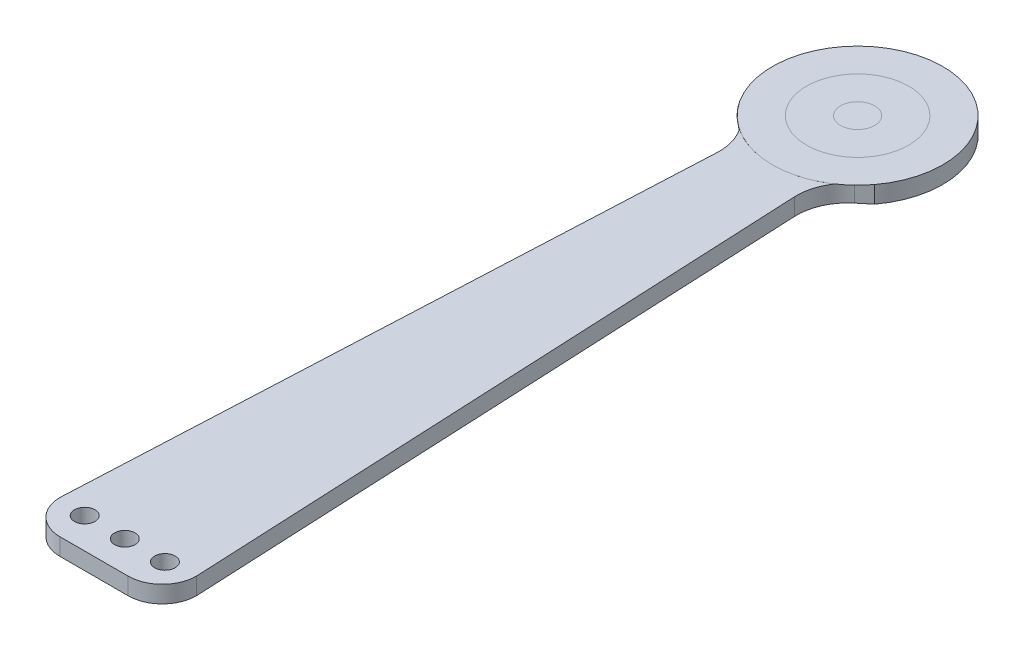
ISO-10303-21;
HEADER;
FILE_DESCRIPTION(('STEP AP214'),'2;1');
FILE_NAME('part.step','',(''),(''),'','','');
FILE_SCHEMA(('AUTOMOTIVE_DESIGN { 1 0 10303 214 1 1 1 1 }'));
ENDSEC;
DATA;
#1=APPLICATION_CONTEXT('core data for automotive mechanical design processes');
#2=APPLICATION_PROTOCOL_DEFINITION('international standard','automotive_design',2000,#1);
#3=PRODUCT_CONTEXT('',#1,'mechanical');
#4=PRODUCT('Part','Part','',(#3));
#5=PRODUCT_RELATED_PRODUCT_CATEGORY('part','',(#4));
#6=PRODUCT_DEFINITION_FORMATION('','',#4);
#7=PRODUCT_DEFINITION_CONTEXT('part definition',#1,'design');
#8=PRODUCT_DEFINITION('design','',#6,#7);
#9=PRODUCT_DEFINITION_SHAPE('','',#8);
#10=(LENGTH_UNIT() NAMED_UNIT(*) SI_UNIT(.MILLI.,.METRE.));
#11=(NAMED_UNIT(*) PLANE_ANGLE_UNIT() SI_UNIT($,.RADIAN.));
#12=(NAMED_UNIT(*) SI_UNIT($,.STERADIAN.) SOLID_ANGLE_UNIT());
#13=UNCERTAINTY_MEASURE_WITH_UNIT(LENGTH_MEASURE(1.E-05),#10,'distance_accuracy_value','');
#14=(GEOMETRIC_REPRESENTATION_CONTEXT(3) GLOBAL_UNCERTAINTY_ASSIGNED_CONTEXT((#13)) GLOBAL_UNIT_ASSIGNED_CONTEXT((#10,
#11,#12)) REPRESENTATION_CONTEXT('',''));
#15=CARTESIAN_POINT('',(0.,0.,0.));
#16=DIRECTION('',(0.,0.,1.));
#17=DIRECTION('',(1.,0.,0.));
#18=AXIS2_PLACEMENT_3D('',#15,#16,#17);
#19=CARTESIAN_POINT('',(0.,5.,0.));
#20=DIRECTION('',(0.,-1.,0.));
#21=DIRECTION('',(0.,0.,-1.));
#22=AXIS2_PLACEMENT_3D('',#19,#20,#21);
#23=CYLINDRICAL_SURFACE('',#22,25.);
#24=CARTESIAN_POINT('',(0.,4.9999,0.));
#25=DIRECTION('',(0.,1.,0.));
#26=DIRECTION('',(0.,0.,1.));
#27=AXIS2_PLACEMENT_3D('',#24,#25,#26);
#28=CIRCLE('',#27,25.);
#29=CARTESIAN_POINT('',(-20.,4.9999,15.));
#30=VERTEX_POINT('',#29);
#31=CARTESIAN_POINT('',(-13.8750923483834,4.9999,20.7961970639786));
#32=VERTEX_POINT('',#31);
#33=EDGE_CURVE('E240',#30,#32,#28,.T.);
#34=ORIENTED_EDGE('',*,*,#33,.T.);
#35=CARTESIAN_POINT('',(13.9801485717998,4.9999,20.7257194304662));
#36=VERTEX_POINT('',#35);
#37=EDGE_CURVE('E57',#32,#36,#28,.T.);
#38=ORIENTED_EDGE('',*,*,#37,.T.);
#39=CARTESIAN_POINT('',(0.,4.9999,0.));
#40=DIRECTION('',(0.,1.,0.));
#41=DIRECTION('',(0.,0.,1.));
#42=AXIS2_PLACEMENT_3D('',#39,#40,#41);
#43=CIRCLE('',#42,25.);
#44=CARTESIAN_POINT('',(20.,4.9999,15.));
#45=VERTEX_POINT('',#44);
#46=EDGE_CURVE('E122',#36,#45,#43,.T.);
#47=ORIENTED_EDGE('',*,*,#46,.T.);
#48=DIRECTION('',(0.,-1.,0.));
#49=VECTOR('',#48,1.);
#50=CARTESIAN_POINT('',(20.,5.,15.));
#51=LINE('',#50,#49);
#52=CARTESIAN_POINT('',(20.,0.,15.));
#53=VERTEX_POINT('',#52);
#54=EDGE_CURVE('E155',#45,#53,#51,.T.);
#55=ORIENTED_EDGE('',*,*,#54,.T.);
#56=CARTESIAN_POINT('',(0.,0.,0.));
#57=DIRECTION('',(0.,1.,0.));
#58=DIRECTION('',(0.,0.,1.));
#59=AXIS2_PLACEMENT_3D('',#56,#57,#58);
#60=CIRCLE('',#59,25.);
#61=CARTESIAN_POINT('',(-20.,0.,15.));
#62=VERTEX_POINT('',#61);
#63=EDGE_CURVE('E229',#53,#62,#60,.T.);
#64=ORIENTED_EDGE('',*,*,#63,.T.);
#65=DIRECTION('',(0.,-1.,0.));
#66=VECTOR('',#65,1.);
#67=CARTESIAN_POINT('',(-20.,5.,15.));
#68=LINE('',#67,#66);
#69=EDGE_CURVE('E196',#30,#62,#68,.T.);
#70=ORIENTED_EDGE('',*,*,#69,.F.);
#71=EDGE_LOOP('',(#34,#38,#47,#55,#64,#70));
#72=FACE_BOUND('',#71,.T.);
#73=CARTESIAN_POINT('',(0.,5.,0.));
#74=DIRECTION('',(0.,1.,0.));
#75=DIRECTION('',(0.,0.,1.));
#76=AXIS2_PLACEMENT_3D('',#73,#74,#75);
#77=CIRCLE('',#76,25.);
#78=CARTESIAN_POINT('',(0.,5.,25.));
#79=VERTEX_POINT('',#78);
#80=EDGE_CURVE('E233',#79,#79,#77,.T.);
#81=ORIENTED_EDGE('',*,*,#80,.F.);
#82=EDGE_LOOP('',(#81));
#83=FACE_BOUND('',#82,.T.);
#84=ADVANCED_FACE('F41',(#72,#83),#23,.T.);
#85=CARTESIAN_POINT('',(0.,5.,0.));
#86=DIRECTION('',(0.,1.,0.));
#87=DIRECTION('',(0.,0.,1.));
#88=AXIS2_PLACEMENT_3D('',#85,#86,#87);
#89=PLANE('',#88);
#90=CARTESIAN_POINT('',(0.,5.,0.));
#91=DIRECTION('',(0.,1.,0.));
#92=DIRECTION('',(0.,0.,1.));
#93=AXIS2_PLACEMENT_3D('',#90,#91,#92);
#94=CIRCLE('',#93,15.);
#95=CARTESIAN_POINT('',(0.,5.,15.));
#96=VERTEX_POINT('',#95);
#97=EDGE_CURVE('E225',#96,#96,#94,.T.);
#98=ORIENTED_EDGE('',*,*,#97,.F.);
#99=EDGE_LOOP('',(#98));
#100=FACE_BOUND('',#99,.T.);
#101=ORIENTED_EDGE('',*,*,#80,.T.);
#102=EDGE_LOOP('',(#101));
#103=FACE_BOUND('',#102,.T.);
#104=ADVANCED_FACE('F328',(#100,#103),#89,.T.);
#105=CARTESIAN_POINT('',(0.,0.,0.));
#106=DIRECTION('',(0.,1.,0.));
#107=DIRECTION('',(0.,0.,1.));
#108=AXIS2_PLACEMENT_3D('',#105,#106,#107);
#109=PLANE('',#108);
#110=DIRECTION('',(-0.770252004426465,0.,0.637739640979776));
#111=VECTOR('',#110,1.);
#112=CARTESIAN_POINT('',(11.0050810900871,0.,22.447453980365));
#113=LINE('',#112,#111);
#114=CARTESIAN_POINT('',(16.7737738304887,0.,17.6711937226255));
#115=VERTEX_POINT('',#114);
#116=EDGE_CURVE('E109',#53,#115,#113,.T.);
#117=ORIENTED_EDGE('',*,*,#116,.T.);
#118=CARTESIAN_POINT('',(26.3398684451853,0.,29.2249737890225));
#119=DIRECTION('',(0.,1.,0.));
#120=DIRECTION('',(0.,0.,1.));
#121=AXIS2_PLACEMENT_3D('',#118,#119,#120);
#122=CIRCLE('',#121,15.);
#123=CARTESIAN_POINT('',(11.356379028025,0.,29.9285680512522));
#124=VERTEX_POINT('',#123);
#125=EDGE_CURVE('E11',#115,#124,#122,.T.);
#126=ORIENTED_EDGE('',*,*,#125,.T.);
#127=DIRECTION('',(0.0469062841486432,0.,0.99889929447736));
#128=VECTOR('',#127,1.);
#129=CARTESIAN_POINT('',(20.,0.,214.));
#130=LINE('',#129,#128);
#131=CARTESIAN_POINT('',(20.,0.,214.));
#132=VERTEX_POINT('',#131);
#133=EDGE_CURVE('E106',#124,#132,#130,.T.);
#134=ORIENTED_EDGE('',*,*,#133,.T.);
#135=CARTESIAN_POINT('',(10.,0.,214.));
#136=DIRECTION('',(0.,1.,0.));
#137=DIRECTION('',(0.,0.,1.));
#138=AXIS2_PLACEMENT_3D('',#135,#136,#137);
#139=CIRCLE('',#138,10.);
#140=CARTESIAN_POINT('',(10.,0.,224.));
#141=VERTEX_POINT('',#140);
#142=EDGE_CURVE('E251',#132,#141,#139,.F.);
#143=ORIENTED_EDGE('',*,*,#142,.T.);
#144=DIRECTION('',(1.,0.,0.));
#145=VECTOR('',#144,1.);
#146=CARTESIAN_POINT('',(0.,0.,224.));
#147=LINE('',#146,#145);
#148=CARTESIAN_POINT('',(-9.99999999999997,0.,224.));
#149=VERTEX_POINT('',#148);
#150=EDGE_CURVE('E184',#149,#141,#147,.T.);
#151=ORIENTED_EDGE('',*,*,#150,.F.);
#152=CARTESIAN_POINT('',(-9.99999999999997,0.,214.));
#153=DIRECTION('',(0.,1.,0.));
#154=DIRECTION('',(0.,0.,1.));
#155=AXIS2_PLACEMENT_3D('',#152,#153,#154);
#156=CIRCLE('',#155,10.);
#157=CARTESIAN_POINT('',(-20.,0.,214.));
#158=VERTEX_POINT('',#157);
#159=EDGE_CURVE('E254',#149,#158,#156,.F.);
#160=ORIENTED_EDGE('',*,*,#159,.T.);
#161=DIRECTION('',(0.0475146342625764,0.,-0.998870541927678));
#162=VECTOR('',#161,1.);
#163=CARTESIAN_POINT('',(-20.,0.,214.));
#164=LINE('',#163,#162);
#165=CARTESIAN_POINT('',(-11.2480653517147,0.,30.0135326573741));
#166=VERTEX_POINT('',#165);
#167=EDGE_CURVE('E162',#158,#166,#164,.T.);
#168=ORIENTED_EDGE('',*,*,#167,.T.);
#169=CARTESIAN_POINT('',(-26.2311234806299,0.,29.3008131434355));
#170=DIRECTION('',(0.,1.,0.));
#171=DIRECTION('',(0.,0.,1.));
#172=AXIS2_PLACEMENT_3D('',#169,#170,#171);
#173=CIRCLE('',#172,15.);
#174=CARTESIAN_POINT('',(-16.6944318337419,0.,17.7227514562541));
#175=VERTEX_POINT('',#174);
#176=EDGE_CURVE('E88',#166,#175,#173,.T.);
#177=ORIENTED_EDGE('',*,*,#176,.T.);
#178=DIRECTION('',(-0.771870779145422,0.,-0.635779443125868));
#179=VECTOR('',#178,1.);
#180=CARTESIAN_POINT('',(-10.8908072359637,0.,22.5031179561651));
#181=LINE('',#180,#179);
#182=EDGE_CURVE('E157',#175,#62,#181,.T.);
#183=ORIENTED_EDGE('',*,*,#182,.T.);
#184=ORIENTED_EDGE('',*,*,#63,.F.);
#185=EDGE_LOOP('',(#117,#126,#134,#143,#151,#160,#168,#177,#183,#184));
#186=FACE_BOUND('',#185,.T.);
#187=CARTESIAN_POINT('',(-11.77,0.,215.));
#188=DIRECTION('',(0.,1.,0.));
#189=DIRECTION('',(0.,0.,1.));
#190=AXIS2_PLACEMENT_3D('',#187,#188,#189);
#191=CIRCLE('',#190,3.);
#192=CARTESIAN_POINT('',(-11.77,0.,218.));
#193=VERTEX_POINT('',#192);
#194=EDGE_CURVE('E178',#193,#193,#191,.T.);
#195=ORIENTED_EDGE('',*,*,#194,.T.);
#196=EDGE_LOOP('',(#195));
#197=FACE_BOUND('',#196,.T.);
#198=CARTESIAN_POINT('',(11.77,0.,215.));
#199=DIRECTION('',(0.,1.,0.));
#200=DIRECTION('',(0.,0.,1.));
#201=AXIS2_PLACEMENT_3D('',#198,#199,#200);
#202=CIRCLE('',#201,3.);
#203=CARTESIAN_POINT('',(11.77,0.,218.));
#204=VERTEX_POINT('',#203);
#205=EDGE_CURVE('E200',#204,#204,#202,.T.);
#206=ORIENTED_EDGE('',*,*,#205,.T.);
#207=EDGE_LOOP('',(#206));
#208=FACE_BOUND('',#207,.T.);
#209=CARTESIAN_POINT('',(0.,0.,215.));
#210=DIRECTION('',(0.,1.,0.));
#211=DIRECTION('',(0.,0.,1.));
#212=AXIS2_PLACEMENT_3D('',#209,#210,#211);
#213=CIRCLE('',#212,3.);
#214=CARTESIAN_POINT('',(0.,0.,218.));
#215=VERTEX_POINT('',#214);
#216=EDGE_CURVE('E204',#215,#215,#213,.T.);
#217=ORIENTED_EDGE('',*,*,#216,.T.);
#218=EDGE_LOOP('',(#217));
#219=FACE_BOUND('',#218,.T.);
#220=ADVANCED_FACE('F102',(#186,#197,#208,#219),#109,.F.);
#221=CARTESIAN_POINT('',(0.,5.0001,0.));
#222=DIRECTION('',(0.,-1.,0.));
#223=DIRECTION('',(0.,0.,-1.));
#224=AXIS2_PLACEMENT_3D('',#221,#222,#223);
#225=CYLINDRICAL_SURFACE('',#224,15.);
#226=CARTESIAN_POINT('',(0.,5.0001,0.));
#227=DIRECTION('',(0.,1.,0.));
#228=DIRECTION('',(0.,0.,1.));
#229=AXIS2_PLACEMENT_3D('',#226,#227,#228);
#230=CIRCLE('',#229,15.);
#231=CARTESIAN_POINT('',(0.,5.0001,15.));
#232=VERTEX_POINT('',#231);
#233=EDGE_CURVE('E220',#232,#232,#230,.T.);
#234=ORIENTED_EDGE('',*,*,#233,.F.);
#235=EDGE_LOOP('',(#234));
#236=FACE_BOUND('',#235,.T.);
#237=ORIENTED_EDGE('',*,*,#97,.T.);
#238=EDGE_LOOP('',(#237));
#239=FACE_BOUND('',#238,.T.);
#240=ADVANCED_FACE('F413',(#236,#239),#225,.T.);
#241=CARTESIAN_POINT('',(0.,5.0001,0.));
#242=DIRECTION('',(0.,1.,0.));
#243=DIRECTION('',(0.,0.,1.));
#244=AXIS2_PLACEMENT_3D('',#241,#242,#243);
#245=PLANE('',#244);
#246=CARTESIAN_POINT('',(0.,5.0001,0.));
#247=DIRECTION('',(0.,1.,0.));
#248=DIRECTION('',(0.,0.,1.));
#249=AXIS2_PLACEMENT_3D('',#246,#247,#248);
#250=CIRCLE('',#249,5.);
#251=CARTESIAN_POINT('',(0.,5.0001,5.));
#252=VERTEX_POINT('',#251);
#253=EDGE_CURVE('E221',#252,#252,#250,.T.);
#254=ORIENTED_EDGE('',*,*,#253,.F.);
#255=EDGE_LOOP('',(#254));
#256=FACE_BOUND('',#255,.T.);
#257=ORIENTED_EDGE('',*,*,#233,.T.);
#258=EDGE_LOOP('',(#257));
#259=FACE_BOUND('',#258,.T.);
#260=ADVANCED_FACE('F489',(#256,#259),#245,.T.);
#261=CARTESIAN_POINT('',(0.,5.0002,0.));
#262=DIRECTION('',(0.,-1.,0.));
#263=DIRECTION('',(0.,0.,-1.));
#264=AXIS2_PLACEMENT_3D('',#261,#262,#263);
#265=CYLINDRICAL_SURFACE('',#264,5.);
#266=CARTESIAN_POINT('',(0.,5.0002,0.));
#267=DIRECTION('',(0.,1.,0.));
#268=DIRECTION('',(0.,0.,1.));
#269=AXIS2_PLACEMENT_3D('',#266,#267,#268);
#270=CIRCLE('',#269,5.);
#271=CARTESIAN_POINT('',(0.,5.0002,5.));
#272=VERTEX_POINT('',#271);
#273=EDGE_CURVE('E216',#272,#272,#270,.T.);
#274=ORIENTED_EDGE('',*,*,#273,.F.);
#275=EDGE_LOOP('',(#274));
#276=FACE_BOUND('',#275,.T.);
#277=ORIENTED_EDGE('',*,*,#253,.T.);
#278=EDGE_LOOP('',(#277));
#279=FACE_BOUND('',#278,.T.);
#280=ADVANCED_FACE('F478',(#276,#279),#265,.T.);
#281=CARTESIAN_POINT('',(0.,5.0002,0.));
#282=DIRECTION('',(0.,1.,0.));
#283=DIRECTION('',(0.,0.,1.));
#284=AXIS2_PLACEMENT_3D('',#281,#282,#283);
#285=PLANE('',#284);
#286=ORIENTED_EDGE('',*,*,#273,.T.);
#287=EDGE_LOOP('',(#286));
#288=FACE_BOUND('',#287,.T.);
#289=ADVANCED_FACE('F468',(#288),#285,.T.);
#290=CARTESIAN_POINT('',(0.,4.9999,215.));
#291=DIRECTION('',(0.,-1.,0.));
#292=DIRECTION('',(0.,0.,-1.));
#293=AXIS2_PLACEMENT_3D('',#290,#291,#292);
#294=CYLINDRICAL_SURFACE('',#293,3.);
#295=CARTESIAN_POINT('',(0.,4.9999,215.));
#296=DIRECTION('',(0.,1.,0.));
#297=DIRECTION('',(0.,0.,1.));
#298=AXIS2_PLACEMENT_3D('',#295,#296,#297);
#299=CIRCLE('',#298,3.);
#300=CARTESIAN_POINT('',(0.,4.9999,218.));
#301=VERTEX_POINT('',#300);
#302=EDGE_CURVE('E188',#301,#301,#299,.T.);
#303=ORIENTED_EDGE('',*,*,#302,.T.);
#304=EDGE_LOOP('',(#303));
#305=FACE_BOUND('',#304,.T.);
#306=ORIENTED_EDGE('',*,*,#216,.F.);
#307=EDGE_LOOP('',(#306));
#308=FACE_BOUND('',#307,.T.);
#309=ADVANCED_FACE('F459',(#305,#308),#294,.F.);
#310=CARTESIAN_POINT('',(11.77,4.9999,215.));
#311=DIRECTION('',(0.,-1.,0.));
#312=DIRECTION('',(0.,0.,-1.));
#313=AXIS2_PLACEMENT_3D('',#310,#311,#312);
#314=CYLINDRICAL_SURFACE('',#313,3.);
#315=CARTESIAN_POINT('',(11.77,4.9999,215.));
#316=DIRECTION('',(0.,1.,0.));
#317=DIRECTION('',(0.,0.,1.));
#318=AXIS2_PLACEMENT_3D('',#315,#316,#317);
#319=CIRCLE('',#318,3.);
#320=CARTESIAN_POINT('',(11.77,4.9999,218.));
#321=VERTEX_POINT('',#320);
#322=EDGE_CURVE('E183',#321,#321,#319,.T.);
#323=ORIENTED_EDGE('',*,*,#322,.T.);
#324=EDGE_LOOP('',(#323));
#325=FACE_BOUND('',#324,.T.);
#326=ORIENTED_EDGE('',*,*,#205,.F.);
#327=EDGE_LOOP('',(#326));
#328=FACE_BOUND('',#327,.T.);
#329=ADVANCED_FACE('F449',(#325,#328),#314,.F.);
#330=CARTESIAN_POINT('',(-11.77,4.9999,215.));
#331=DIRECTION('',(0.,-1.,0.));
#332=DIRECTION('',(0.,0.,-1.));
#333=AXIS2_PLACEMENT_3D('',#330,#331,#332);
#334=CYLINDRICAL_SURFACE('',#333,3.);
#335=CARTESIAN_POINT('',(-11.77,4.9999,215.));
#336=DIRECTION('',(0.,1.,0.));
#337=DIRECTION('',(0.,0.,1.));
#338=AXIS2_PLACEMENT_3D('',#335,#336,#337);
#339=CIRCLE('',#338,3.);
#340=CARTESIAN_POINT('',(-11.77,4.9999,218.));
#341=VERTEX_POINT('',#340);
#342=EDGE_CURVE('E179',#341,#341,#339,.T.);
#343=ORIENTED_EDGE('',*,*,#342,.T.);
#344=EDGE_LOOP('',(#343));
#345=FACE_BOUND('',#344,.T.);
#346=ORIENTED_EDGE('',*,*,#194,.F.);
#347=EDGE_LOOP('',(#346));
#348=FACE_BOUND('',#347,.T.);
#349=ADVANCED_FACE('F439',(#345,#348),#334,.F.);
#350=CARTESIAN_POINT('',(0.,4.9999,224.));
#351=DIRECTION('',(0.,0.,-1.));
#352=DIRECTION('',(-1.,0.,0.));
#353=AXIS2_PLACEMENT_3D('',#350,#351,#352);
#354=PLANE('',#353);
#355=DIRECTION('',(1.,0.,0.));
#356=VECTOR('',#355,1.);
#357=CARTESIAN_POINT('',(0.,4.9999,224.));
#358=LINE('',#357,#356);
#359=CARTESIAN_POINT('',(-9.99999999999997,4.9999,224.));
#360=VERTEX_POINT('',#359);
#361=CARTESIAN_POINT('',(10.,4.9999,224.));
#362=VERTEX_POINT('',#361);
#363=EDGE_CURVE('E192',#360,#362,#358,.T.);
#364=ORIENTED_EDGE('',*,*,#363,.F.);
#365=DIRECTION('',(0.,-1.,0.));
#366=VECTOR('',#365,1.);
#367=CARTESIAN_POINT('',(-9.99999999999997,4.9999,224.));
#368=LINE('',#367,#366);
#369=EDGE_CURVE('E247',#360,#149,#368,.T.);
#370=ORIENTED_EDGE('',*,*,#369,.T.);
#371=ORIENTED_EDGE('',*,*,#150,.T.);
#372=DIRECTION('',(0.,-1.,0.));
#373=VECTOR('',#372,1.);
#374=CARTESIAN_POINT('',(10.,4.9999,224.));
#375=LINE('',#374,#373);
#376=EDGE_CURVE('E243',#141,#362,#375,.F.);
#377=ORIENTED_EDGE('',*,*,#376,.T.);
#378=EDGE_LOOP('',(#364,#370,#371,#377));
#379=FACE_BOUND('',#378,.T.);
#380=ADVANCED_FACE('F402',(#379),#354,.F.);
#381=CARTESIAN_POINT('',(0.,4.9999,0.));
#382=DIRECTION('',(0.,1.,0.));
#383=DIRECTION('',(0.,0.,1.));
#384=AXIS2_PLACEMENT_3D('',#381,#382,#383);
#385=PLANE('',#384);
#386=DIRECTION('',(0.0469062841486432,0.,0.99889929447736));
#387=VECTOR('',#386,1.);
#388=CARTESIAN_POINT('',(20.,4.9999,214.));
#389=LINE('',#388,#387);
#390=CARTESIAN_POINT('',(11.356379028025,4.9999,29.9285680512522));
#391=VERTEX_POINT('',#390);
#392=CARTESIAN_POINT('',(20.,4.9999,214.));
#393=VERTEX_POINT('',#392);
#394=EDGE_CURVE('E146',#391,#393,#389,.T.);
#395=ORIENTED_EDGE('',*,*,#394,.F.);
#396=CARTESIAN_POINT('',(26.3398684451853,4.9999,29.2249737890225));
#397=DIRECTION('',(0.,1.,0.));
#398=DIRECTION('',(0.,0.,1.));
#399=AXIS2_PLACEMENT_3D('',#396,#397,#398);
#400=CIRCLE('',#399,15.);
#401=EDGE_CURVE('E50',#391,#36,#400,.F.);
#402=ORIENTED_EDGE('',*,*,#401,.T.);
#403=ORIENTED_EDGE('',*,*,#37,.F.);
#404=CARTESIAN_POINT('',(-26.2311234806299,4.9999,29.3008131434355));
#405=DIRECTION('',(0.,1.,0.));
#406=DIRECTION('',(0.,0.,1.));
#407=AXIS2_PLACEMENT_3D('',#404,#405,#406);
#408=CIRCLE('',#407,15.);
#409=CARTESIAN_POINT('',(-11.2480653517147,4.9999,30.0135326573741));
#410=VERTEX_POINT('',#409);
#411=EDGE_CURVE('E138',#32,#410,#408,.F.);
#412=ORIENTED_EDGE('',*,*,#411,.T.);
#413=DIRECTION('',(0.0475146342625764,0.,-0.998870541927678));
#414=VECTOR('',#413,1.);
#415=CARTESIAN_POINT('',(-20.,4.9999,214.));
#416=LINE('',#415,#414);
#417=CARTESIAN_POINT('',(-20.,4.9999,214.));
#418=VERTEX_POINT('',#417);
#419=EDGE_CURVE('E169',#418,#410,#416,.T.);
#420=ORIENTED_EDGE('',*,*,#419,.F.);
#421=CARTESIAN_POINT('',(-9.99999999999997,4.9999,214.));
#422=DIRECTION('',(0.,1.,0.));
#423=DIRECTION('',(0.,0.,1.));
#424=AXIS2_PLACEMENT_3D('',#421,#422,#423);
#425=CIRCLE('',#424,10.);
#426=EDGE_CURVE('E265',#418,#360,#425,.T.);
#427=ORIENTED_EDGE('',*,*,#426,.T.);
#428=ORIENTED_EDGE('',*,*,#363,.T.);
#429=CARTESIAN_POINT('',(10.,4.9999,214.));
#430=DIRECTION('',(0.,1.,0.));
#431=DIRECTION('',(0.,0.,1.));
#432=AXIS2_PLACEMENT_3D('',#429,#430,#431);
#433=CIRCLE('',#432,10.);
#434=EDGE_CURVE('E262',#362,#393,#433,.T.);
#435=ORIENTED_EDGE('',*,*,#434,.T.);
#436=EDGE_LOOP('',(#395,#402,#403,#412,#420,#427,#428,#435));
#437=FACE_BOUND('',#436,.T.);
#438=ORIENTED_EDGE('',*,*,#342,.F.);
#439=EDGE_LOOP('',(#438));
#440=FACE_BOUND('',#439,.T.);
#441=ORIENTED_EDGE('',*,*,#322,.F.);
#442=EDGE_LOOP('',(#441));
#443=FACE_BOUND('',#442,.T.);
#444=ORIENTED_EDGE('',*,*,#302,.F.);
#445=EDGE_LOOP('',(#444));
#446=FACE_BOUND('',#445,.T.);
#447=ADVANCED_FACE('F143',(#437,#440,#443,#446),#385,.T.);
#448=CARTESIAN_POINT('',(-9.99999999999997,4.9999,214.));
#449=DIRECTION('',(0.,-1.,0.));
#450=DIRECTION('',(0.,0.,-1.));
#451=AXIS2_PLACEMENT_3D('',#448,#449,#450);
#452=CYLINDRICAL_SURFACE('',#451,10.);
#453=ORIENTED_EDGE('',*,*,#426,.F.);
#454=DIRECTION('',(0.,-1.,0.));
#455=VECTOR('',#454,1.);
#456=CARTESIAN_POINT('',(-20.,4.9999,214.));
#457=LINE('',#456,#455);
#458=EDGE_CURVE('E258',#158,#418,#457,.F.);
#459=ORIENTED_EDGE('',*,*,#458,.F.);
#460=ORIENTED_EDGE('',*,*,#159,.F.);
#461=ORIENTED_EDGE('',*,*,#369,.F.);
#462=EDGE_LOOP('',(#453,#459,#460,#461));
#463=FACE_BOUND('',#462,.T.);
#464=ADVANCED_FACE('F298',(#463),#452,.T.);
#465=CARTESIAN_POINT('',(10.,4.9999,214.));
#466=DIRECTION('',(0.,1.,0.));
#467=DIRECTION('',(0.,0.,1.));
#468=AXIS2_PLACEMENT_3D('',#465,#466,#467);
#469=CYLINDRICAL_SURFACE('',#468,10.);
#470=ORIENTED_EDGE('',*,*,#434,.F.);
#471=ORIENTED_EDGE('',*,*,#376,.F.);
#472=ORIENTED_EDGE('',*,*,#142,.F.);
#473=DIRECTION('',(0.,-1.,0.));
#474=VECTOR('',#473,1.);
#475=CARTESIAN_POINT('',(20.,0.,214.));
#476=LINE('',#475,#474);
#477=EDGE_CURVE('E119',#393,#132,#476,.T.);
#478=ORIENTED_EDGE('',*,*,#477,.F.);
#479=EDGE_LOOP('',(#470,#471,#472,#478));
#480=FACE_BOUND('',#479,.T.);
#481=ADVANCED_FACE('F339',(#480),#469,.T.);
#482=CARTESIAN_POINT('',(0.,4.9999,0.));
#483=DIRECTION('',(0.,1.,0.));
#484=DIRECTION('',(0.,0.,1.));
#485=AXIS2_PLACEMENT_3D('',#482,#483,#484);
#486=PLANE('',#485);
#487=ORIENTED_EDGE('',*,*,#46,.F.);
#488=CARTESIAN_POINT('',(26.3398684451853,4.9999,29.2249737890225));
#489=DIRECTION('',(0.,1.,0.));
#490=DIRECTION('',(0.,0.,1.));
#491=AXIS2_PLACEMENT_3D('',#488,#489,#490);
#492=CIRCLE('',#491,15.);
#493=CARTESIAN_POINT('',(16.7737738304887,4.9999,17.6711937226255));
#494=VERTEX_POINT('',#493);
#495=EDGE_CURVE('E126',#36,#494,#492,.F.);
#496=ORIENTED_EDGE('',*,*,#495,.T.);
#497=DIRECTION('',(-0.770252004426465,0.,0.637739640979776));
#498=VECTOR('',#497,1.);
#499=CARTESIAN_POINT('',(11.0050810900871,4.9999,22.447453980365));
#500=LINE('',#499,#498);
#501=EDGE_CURVE('E151',#45,#494,#500,.T.);
#502=ORIENTED_EDGE('',*,*,#501,.F.);
#503=EDGE_LOOP('',(#487,#496,#502));
#504=FACE_BOUND('',#503,.T.);
#505=ADVANCED_FACE('F149',(#504),#486,.F.);
#506=CARTESIAN_POINT('',(20.,0.,214.));
#507=DIRECTION('',(-0.99889929447736,0.,0.0469062841486432));
#508=DIRECTION('',(0.0469062841486432,0.,0.99889929447736));
#509=AXIS2_PLACEMENT_3D('',#506,#507,#508);
#510=PLANE('',#509);
#511=ORIENTED_EDGE('',*,*,#133,.F.);
#512=DIRECTION('',(0.,1.,0.));
#513=VECTOR('',#512,1.);
#514=CARTESIAN_POINT('',(11.3563790280249,4.9999,29.9285680512522));
#515=LINE('',#514,#513);
#516=EDGE_CURVE('E116',#124,#391,#515,.T.);
#517=ORIENTED_EDGE('',*,*,#516,.T.);
#518=ORIENTED_EDGE('',*,*,#394,.T.);
#519=ORIENTED_EDGE('',*,*,#477,.T.);
#520=EDGE_LOOP('',(#511,#517,#518,#519));
#521=FACE_BOUND('',#520,.T.);
#522=ADVANCED_FACE('F114',(#521),#510,.F.);
#523=CARTESIAN_POINT('',(11.0050810900871,0.,22.447453980365));
#524=DIRECTION('',(-0.637739640979776,0.,-0.770252004426465));
#525=DIRECTION('',(-0.770252004426465,0.,0.637739640979776));
#526=AXIS2_PLACEMENT_3D('',#523,#524,#525);
#527=PLANE('',#526);
#528=ORIENTED_EDGE('',*,*,#501,.T.);
#529=DIRECTION('',(0.,1.,0.));
#530=VECTOR('',#529,1.);
#531=CARTESIAN_POINT('',(16.7737738304887,0.,17.6711937226255));
#532=LINE('',#531,#530);
#533=EDGE_CURVE('E66',#494,#115,#532,.F.);
#534=ORIENTED_EDGE('',*,*,#533,.T.);
#535=ORIENTED_EDGE('',*,*,#116,.F.);
#536=ORIENTED_EDGE('',*,*,#54,.F.);
#537=EDGE_LOOP('',(#528,#534,#535,#536));
#538=FACE_BOUND('',#537,.T.);
#539=ADVANCED_FACE('F153',(#538),#527,.F.);
#540=CARTESIAN_POINT('',(0.,4.9999,0.));
#541=DIRECTION('',(0.,-1.,0.));
#542=DIRECTION('',(0.,0.,-1.));
#543=AXIS2_PLACEMENT_3D('',#540,#541,#542);
#544=PLANE('',#543);
#545=DIRECTION('',(-0.771870779145422,0.,-0.635779443125868));
#546=VECTOR('',#545,1.);
#547=CARTESIAN_POINT('',(-10.8908072359637,4.9999,22.5031179561651));
#548=LINE('',#547,#546);
#549=CARTESIAN_POINT('',(-16.6944318337419,4.9999,17.7227514562541));
#550=VERTEX_POINT('',#549);
#551=EDGE_CURVE('E167',#550,#30,#548,.T.);
#552=ORIENTED_EDGE('',*,*,#551,.F.);
#553=CARTESIAN_POINT('',(-26.2311234806299,4.9999,29.3008131434355));
#554=DIRECTION('',(0.,-1.,0.));
#555=DIRECTION('',(0.,0.,-1.));
#556=AXIS2_PLACEMENT_3D('',#553,#554,#555);
#557=CIRCLE('',#556,15.);
#558=EDGE_CURVE('E132',#550,#32,#557,.T.);
#559=ORIENTED_EDGE('',*,*,#558,.T.);
#560=ORIENTED_EDGE('',*,*,#33,.F.);
#561=EDGE_LOOP('',(#552,#559,#560));
#562=FACE_BOUND('',#561,.T.);
#563=ADVANCED_FACE('F278',(#562),#544,.T.);
#564=CARTESIAN_POINT('',(-10.8908072359637,0.,22.5031179561651));
#565=DIRECTION('',(0.635779443125868,0.,-0.771870779145422));
#566=DIRECTION('',(-0.771870779145422,0.,-0.635779443125868));
#567=AXIS2_PLACEMENT_3D('',#564,#565,#566);
#568=PLANE('',#567);
#569=ORIENTED_EDGE('',*,*,#182,.F.);
#570=DIRECTION('',(0.,1.,0.));
#571=VECTOR('',#570,1.);
#572=CARTESIAN_POINT('',(-16.6944318337419,4.9999,17.7227514562541));
#573=LINE('',#572,#571);
#574=EDGE_CURVE('E271',#175,#550,#573,.T.);
#575=ORIENTED_EDGE('',*,*,#574,.T.);
#576=ORIENTED_EDGE('',*,*,#551,.T.);
#577=ORIENTED_EDGE('',*,*,#69,.T.);
#578=EDGE_LOOP('',(#569,#575,#576,#577));
#579=FACE_BOUND('',#578,.T.);
#580=ADVANCED_FACE('F318',(#579),#568,.F.);
#581=CARTESIAN_POINT('',(-20.,0.,214.));
#582=DIRECTION('',(0.998870541927678,0.,0.0475146342625764));
#583=DIRECTION('',(0.0475146342625764,0.,-0.998870541927678));
#584=AXIS2_PLACEMENT_3D('',#581,#582,#583);
#585=PLANE('',#584);
#586=ORIENTED_EDGE('',*,*,#419,.T.);
#587=DIRECTION('',(0.,1.,0.));
#588=VECTOR('',#587,1.);
#589=CARTESIAN_POINT('',(-11.2480653517147,0.,30.0135326573741));
#590=LINE('',#589,#588);
#591=EDGE_CURVE('E127',#410,#166,#590,.F.);
#592=ORIENTED_EDGE('',*,*,#591,.T.);
#593=ORIENTED_EDGE('',*,*,#167,.F.);
#594=ORIENTED_EDGE('',*,*,#458,.T.);
#595=EDGE_LOOP('',(#586,#592,#593,#594));
#596=FACE_BOUND('',#595,.T.);
#597=ADVANCED_FACE('F291',(#596),#585,.F.);
#598=CARTESIAN_POINT('',(-26.2311234806299,0.,29.3008131434355));
#599=DIRECTION('',(0.,-1.,0.));
#600=DIRECTION('',(0.,0.,-1.));
#601=AXIS2_PLACEMENT_3D('',#598,#599,#600);
#602=CYLINDRICAL_SURFACE('',#601,15.);
#603=ORIENTED_EDGE('',*,*,#176,.F.);
#604=ORIENTED_EDGE('',*,*,#591,.F.);
#605=ORIENTED_EDGE('',*,*,#411,.F.);
#606=ORIENTED_EDGE('',*,*,#558,.F.);
#607=ORIENTED_EDGE('',*,*,#574,.F.);
#608=EDGE_LOOP('',(#603,#604,#605,#606,#607));
#609=FACE_BOUND('',#608,.T.);
#610=ADVANCED_FACE('F286',(#609),#602,.F.);
#611=CARTESIAN_POINT('',(26.3398684451853,0.,29.2249737890225));
#612=DIRECTION('',(0.,-1.,0.));
#613=DIRECTION('',(0.,0.,-1.));
#614=AXIS2_PLACEMENT_3D('',#611,#612,#613);
#615=CYLINDRICAL_SURFACE('',#614,15.);
#616=ORIENTED_EDGE('',*,*,#125,.F.);
#617=ORIENTED_EDGE('',*,*,#533,.F.);
#618=ORIENTED_EDGE('',*,*,#495,.F.);
#619=ORIENTED_EDGE('',*,*,#401,.F.);
#620=ORIENTED_EDGE('',*,*,#516,.F.);
#621=EDGE_LOOP('',(#616,#617,#618,#619,#620));
#622=FACE_BOUND('',#621,.T.);
#623=ADVANCED_FACE('F43',(#622),#615,.F.);
#624=CLOSED_SHELL('',(#84,#104,#220,#240,#260,#280,#289,#309,#329,#349,#380,#447,#464,#481,#505,
#522,#539,#563,#580,#597,#610,#623));
#625=MANIFOLD_SOLID_BREP('B2',#624);
#626=ADVANCED_BREP_SHAPE_REPRESENTATION('',(#18,#625),#14);
#627=SHAPE_DEFINITION_REPRESENTATION(#9,#626);
ENDSEC;
END-ISO-10303-21;
